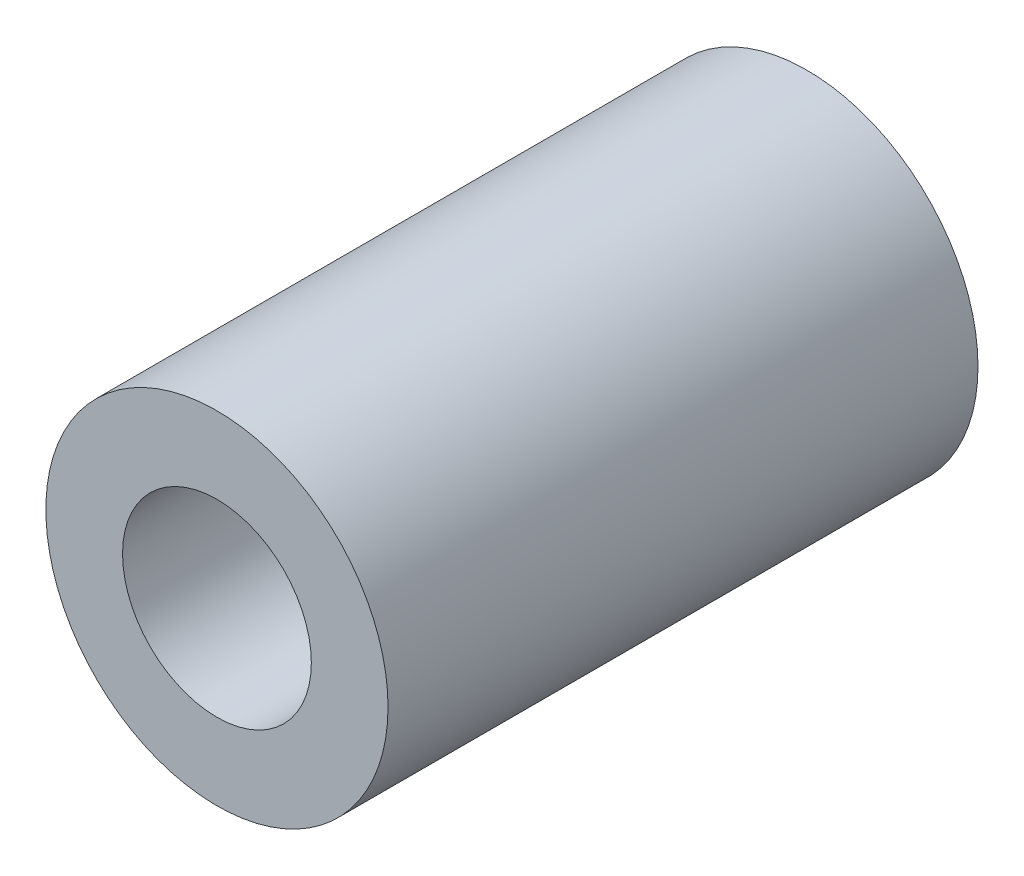
ISO-10303-21;
HEADER;
FILE_DESCRIPTION(('STEP AP214'),'2;1');
FILE_NAME('part.step','',(''),(''),'','','');
FILE_SCHEMA(('AUTOMOTIVE_DESIGN { 1 0 10303 214 1 1 1 1 }'));
ENDSEC;
DATA;
#1=APPLICATION_CONTEXT('core data for automotive mechanical design processes');
#2=APPLICATION_PROTOCOL_DEFINITION('international standard','automotive_design',2000,#1);
#3=PRODUCT_CONTEXT('',#1,'mechanical');
#4=PRODUCT('Part','Part','',(#3));
#5=PRODUCT_RELATED_PRODUCT_CATEGORY('part','',(#4));
#6=PRODUCT_DEFINITION_FORMATION('','',#4);
#7=PRODUCT_DEFINITION_CONTEXT('part definition',#1,'design');
#8=PRODUCT_DEFINITION('design','',#6,#7);
#9=PRODUCT_DEFINITION_SHAPE('','',#8);
#10=(LENGTH_UNIT() NAMED_UNIT(*) SI_UNIT(.MILLI.,.METRE.));
#11=(NAMED_UNIT(*) PLANE_ANGLE_UNIT() SI_UNIT($,.RADIAN.));
#12=(NAMED_UNIT(*) SI_UNIT($,.STERADIAN.) SOLID_ANGLE_UNIT());
#13=UNCERTAINTY_MEASURE_WITH_UNIT(LENGTH_MEASURE(1.E-05),#10,'distance_accuracy_value','');
#14=(GEOMETRIC_REPRESENTATION_CONTEXT(3) GLOBAL_UNCERTAINTY_ASSIGNED_CONTEXT((#13)) GLOBAL_UNIT_ASSIGNED_CONTEXT((#10,
#11,#12)) REPRESENTATION_CONTEXT('',''));
#15=CARTESIAN_POINT('',(0.,0.,0.));
#16=DIRECTION('',(0.,0.,1.));
#17=DIRECTION('',(1.,0.,0.));
#18=AXIS2_PLACEMENT_3D('',#15,#16,#17);
#19=CARTESIAN_POINT('',(0.,0.,10.));
#20=DIRECTION('',(0.,0.,1.));
#21=DIRECTION('',(1.,0.,0.));
#22=AXIS2_PLACEMENT_3D('',#19,#20,#21);
#23=PLANE('',#22);
#24=CARTESIAN_POINT('',(0.,0.,10.));
#25=DIRECTION('',(0.,0.,1.));
#26=DIRECTION('',(1.,0.,0.));
#27=AXIS2_PLACEMENT_3D('',#24,#25,#26);
#28=CIRCLE('',#27,2.9);
#29=CARTESIAN_POINT('',(2.9,0.,10.));
#30=VERTEX_POINT('',#29);
#31=EDGE_CURVE('E10',#30,#30,#28,.T.);
#32=ORIENTED_EDGE('',*,*,#31,.T.);
#33=EDGE_LOOP('',(#32));
#34=FACE_BOUND('',#33,.T.);
#35=CARTESIAN_POINT('',(0.,0.,10.));
#36=DIRECTION('',(0.,0.,1.));
#37=DIRECTION('',(1.,0.,0.));
#38=AXIS2_PLACEMENT_3D('',#35,#36,#37);
#39=CIRCLE('',#38,1.6);
#40=CARTESIAN_POINT('',(1.6,0.,10.));
#41=VERTEX_POINT('',#40);
#42=EDGE_CURVE('E42',#41,#41,#39,.T.);
#43=ORIENTED_EDGE('',*,*,#42,.F.);
#44=EDGE_LOOP('',(#43));
#45=FACE_BOUND('',#44,.T.);
#46=ADVANCED_FACE('F31',(#34,#45),#23,.T.);
#47=CARTESIAN_POINT('',(0.,0.,0.));
#48=DIRECTION('',(0.,0.,1.));
#49=DIRECTION('',(1.,0.,0.));
#50=AXIS2_PLACEMENT_3D('',#47,#48,#49);
#51=PLANE('',#50);
#52=CARTESIAN_POINT('',(0.,0.,0.));
#53=DIRECTION('',(0.,0.,1.));
#54=DIRECTION('',(1.,0.,0.));
#55=AXIS2_PLACEMENT_3D('',#52,#53,#54);
#56=CIRCLE('',#55,2.9);
#57=CARTESIAN_POINT('',(2.9,0.,0.));
#58=VERTEX_POINT('',#57);
#59=EDGE_CURVE('E35',#58,#58,#56,.T.);
#60=ORIENTED_EDGE('',*,*,#59,.F.);
#61=EDGE_LOOP('',(#60));
#62=FACE_BOUND('',#61,.T.);
#63=CARTESIAN_POINT('',(0.,0.,0.));
#64=DIRECTION('',(0.,0.,1.));
#65=DIRECTION('',(1.,0.,0.));
#66=AXIS2_PLACEMENT_3D('',#63,#64,#65);
#67=CIRCLE('',#66,1.6);
#68=CARTESIAN_POINT('',(1.6,0.,0.));
#69=VERTEX_POINT('',#68);
#70=EDGE_CURVE('E44',#69,#69,#67,.T.);
#71=ORIENTED_EDGE('',*,*,#70,.T.);
#72=EDGE_LOOP('',(#71));
#73=FACE_BOUND('',#72,.T.);
#74=ADVANCED_FACE('F54',(#62,#73),#51,.F.);
#75=CARTESIAN_POINT('',(0.,0.,10.));
#76=DIRECTION('',(0.,0.,-1.));
#77=DIRECTION('',(-1.,0.,0.));
#78=AXIS2_PLACEMENT_3D('',#75,#76,#77);
#79=CYLINDRICAL_SURFACE('',#78,2.9);
#80=ORIENTED_EDGE('',*,*,#31,.F.);
#81=EDGE_LOOP('',(#80));
#82=FACE_BOUND('',#81,.T.);
#83=ORIENTED_EDGE('',*,*,#59,.T.);
#84=EDGE_LOOP('',(#83));
#85=FACE_BOUND('',#84,.T.);
#86=ADVANCED_FACE('F33',(#82,#85),#79,.T.);
#87=CARTESIAN_POINT('',(0.,0.,10.));
#88=DIRECTION('',(0.,0.,-1.));
#89=DIRECTION('',(-1.,0.,0.));
#90=AXIS2_PLACEMENT_3D('',#87,#88,#89);
#91=CYLINDRICAL_SURFACE('',#90,1.6);
#92=ORIENTED_EDGE('',*,*,#42,.T.);
#93=EDGE_LOOP('',(#92));
#94=FACE_BOUND('',#93,.T.);
#95=ORIENTED_EDGE('',*,*,#70,.F.);
#96=EDGE_LOOP('',(#95));
#97=FACE_BOUND('',#96,.T.);
#98=ADVANCED_FACE('F50',(#94,#97),#91,.F.);
#99=CLOSED_SHELL('',(#46,#74,#86,#98));
#100=MANIFOLD_SOLID_BREP('B2',#99);
#101=ADVANCED_BREP_SHAPE_REPRESENTATION('',(#18,#100),#14);
#102=SHAPE_DEFINITION_REPRESENTATION(#9,#101);
ENDSEC;
END-ISO-10303-21;
